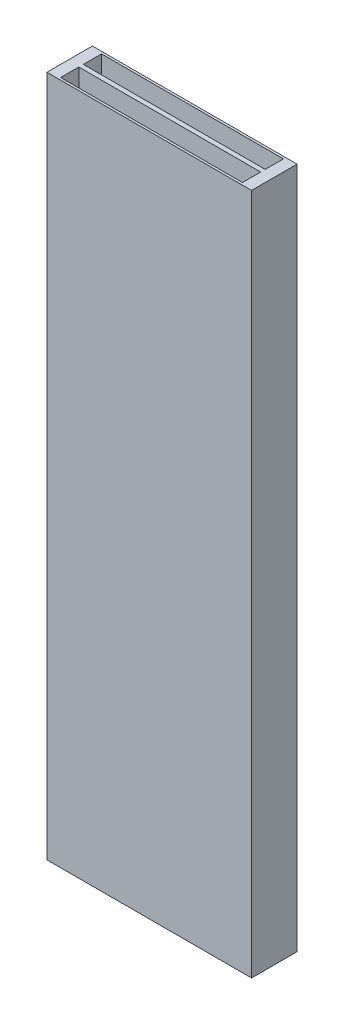
ISO-10303-21;
HEADER;
FILE_DESCRIPTION(('STEP AP214'),'2;1');
FILE_NAME('part.step','',(''),(''),'','','');
FILE_SCHEMA(('AUTOMOTIVE_DESIGN { 1 0 10303 214 1 1 1 1 }'));
ENDSEC;
DATA;
#1=APPLICATION_CONTEXT('core data for automotive mechanical design processes');
#2=APPLICATION_PROTOCOL_DEFINITION('international standard','automotive_design',2000,#1);
#3=PRODUCT_CONTEXT('',#1,'mechanical');
#4=PRODUCT('Part','Part','',(#3));
#5=PRODUCT_RELATED_PRODUCT_CATEGORY('part','',(#4));
#6=PRODUCT_DEFINITION_FORMATION('','',#4);
#7=PRODUCT_DEFINITION_CONTEXT('part definition',#1,'design');
#8=PRODUCT_DEFINITION('design','',#6,#7);
#9=PRODUCT_DEFINITION_SHAPE('','',#8);
#10=(LENGTH_UNIT() NAMED_UNIT(*) SI_UNIT(.MILLI.,.METRE.));
#11=(NAMED_UNIT(*) PLANE_ANGLE_UNIT() SI_UNIT($,.RADIAN.));
#12=(NAMED_UNIT(*) SI_UNIT($,.STERADIAN.) SOLID_ANGLE_UNIT());
#13=UNCERTAINTY_MEASURE_WITH_UNIT(LENGTH_MEASURE(1.E-05),#10,'distance_accuracy_value','');
#14=(GEOMETRIC_REPRESENTATION_CONTEXT(3) GLOBAL_UNCERTAINTY_ASSIGNED_CONTEXT((#13)) GLOBAL_UNIT_ASSIGNED_CONTEXT((#10,
#11,#12)) REPRESENTATION_CONTEXT('',''));
#15=CARTESIAN_POINT('',(0.,0.,0.));
#16=DIRECTION('',(0.,0.,1.));
#17=DIRECTION('',(1.,0.,0.));
#18=AXIS2_PLACEMENT_3D('',#15,#16,#17);
#19=CARTESIAN_POINT('',(0.,15.,0.));
#20=DIRECTION('',(0.,-1.,0.));
#21=DIRECTION('',(0.,0.,-1.));
#22=AXIS2_PLACEMENT_3D('',#19,#20,#21);
#23=PLANE('',#22);
#24=DIRECTION('',(0.,0.,-1.));
#25=VECTOR('',#24,1.);
#26=CARTESIAN_POINT('',(4.5,15.,1.));
#27=LINE('',#26,#25);
#28=CARTESIAN_POINT('',(4.5,15.,1.));
#29=VERTEX_POINT('',#28);
#30=CARTESIAN_POINT('',(4.5,15.,-1.));
#31=VERTEX_POINT('',#30);
#32=EDGE_CURVE('E194',#29,#31,#27,.T.);
#33=ORIENTED_EDGE('',*,*,#32,.T.);
#34=DIRECTION('',(-1.,0.,0.));
#35=VECTOR('',#34,1.);
#36=CARTESIAN_POINT('',(-4.5,15.,-1.));
#37=LINE('',#36,#35);
#38=CARTESIAN_POINT('',(-4.5,15.,-1.));
#39=VERTEX_POINT('',#38);
#40=EDGE_CURVE('E197',#31,#39,#37,.T.);
#41=ORIENTED_EDGE('',*,*,#40,.T.);
#42=DIRECTION('',(0.,0.,1.));
#43=VECTOR('',#42,1.);
#44=CARTESIAN_POINT('',(-4.5,15.,1.));
#45=LINE('',#44,#43);
#46=CARTESIAN_POINT('',(-4.5,15.,1.));
#47=VERTEX_POINT('',#46);
#48=EDGE_CURVE('E200',#39,#47,#45,.T.);
#49=ORIENTED_EDGE('',*,*,#48,.T.);
#50=DIRECTION('',(1.,0.,0.));
#51=VECTOR('',#50,1.);
#52=CARTESIAN_POINT('',(-4.5,15.,1.));
#53=LINE('',#52,#51);
#54=EDGE_CURVE('E202',#47,#29,#53,.T.);
#55=ORIENTED_EDGE('',*,*,#54,.T.);
#56=EDGE_LOOP('',(#33,#41,#49,#55));
#57=FACE_BOUND('',#56,.T.);
#58=DIRECTION('',(1.,0.,0.));
#59=VECTOR('',#58,1.);
#60=CARTESIAN_POINT('',(0.,15.,-0.9));
#61=LINE('',#60,#59);
#62=CARTESIAN_POINT('',(-4.,15.,-0.9));
#63=VERTEX_POINT('',#62);
#64=CARTESIAN_POINT('',(4.,15.,-0.9));
#65=VERTEX_POINT('',#64);
#66=EDGE_CURVE('E174',#63,#65,#61,.T.);
#67=ORIENTED_EDGE('',*,*,#66,.T.);
#68=DIRECTION('',(0.,0.,1.));
#69=VECTOR('',#68,1.);
#70=CARTESIAN_POINT('',(4.,15.,0.));
#71=LINE('',#70,#69);
#72=CARTESIAN_POINT('',(4.,15.,-0.1));
#73=VERTEX_POINT('',#72);
#74=EDGE_CURVE('E190',#65,#73,#71,.T.);
#75=ORIENTED_EDGE('',*,*,#74,.T.);
#76=DIRECTION('',(-1.,0.,0.));
#77=VECTOR('',#76,1.);
#78=CARTESIAN_POINT('',(0.,15.,-0.1));
#79=LINE('',#78,#77);
#80=CARTESIAN_POINT('',(-4.,15.,-0.1));
#81=VERTEX_POINT('',#80);
#82=EDGE_CURVE('E187',#73,#81,#79,.T.);
#83=ORIENTED_EDGE('',*,*,#82,.T.);
#84=DIRECTION('',(0.,0.,-1.));
#85=VECTOR('',#84,1.);
#86=CARTESIAN_POINT('',(-4.,15.,0.));
#87=LINE('',#86,#85);
#88=EDGE_CURVE('E184',#81,#63,#87,.T.);
#89=ORIENTED_EDGE('',*,*,#88,.T.);
#90=EDGE_LOOP('',(#67,#75,#83,#89));
#91=FACE_BOUND('',#90,.T.);
#92=DIRECTION('',(0.,0.,-1.));
#93=VECTOR('',#92,1.);
#94=CARTESIAN_POINT('',(4.,15.,0.));
#95=LINE('',#94,#93);
#96=CARTESIAN_POINT('',(4.,15.,0.9));
#97=VERTEX_POINT('',#96);
#98=CARTESIAN_POINT('',(4.,15.,0.1));
#99=VERTEX_POINT('',#98);
#100=EDGE_CURVE('E135',#97,#99,#95,.T.);
#101=ORIENTED_EDGE('',*,*,#100,.F.);
#102=DIRECTION('',(1.,0.,0.));
#103=VECTOR('',#102,1.);
#104=CARTESIAN_POINT('',(0.,15.,0.9));
#105=LINE('',#104,#103);
#106=CARTESIAN_POINT('',(-4.,15.,0.9));
#107=VERTEX_POINT('',#106);
#108=EDGE_CURVE('E155',#107,#97,#105,.T.);
#109=ORIENTED_EDGE('',*,*,#108,.F.);
#110=DIRECTION('',(0.,0.,1.));
#111=VECTOR('',#110,1.);
#112=CARTESIAN_POINT('',(-4.,15.,0.));
#113=LINE('',#112,#111);
#114=CARTESIAN_POINT('',(-4.,15.,0.1));
#115=VERTEX_POINT('',#114);
#116=EDGE_CURVE('E153',#115,#107,#113,.T.);
#117=ORIENTED_EDGE('',*,*,#116,.F.);
#118=DIRECTION('',(-1.,0.,0.));
#119=VECTOR('',#118,1.);
#120=CARTESIAN_POINT('',(0.,15.,0.1));
#121=LINE('',#120,#119);
#122=EDGE_CURVE('E147',#99,#115,#121,.T.);
#123=ORIENTED_EDGE('',*,*,#122,.F.);
#124=EDGE_LOOP('',(#101,#109,#117,#123));
#125=FACE_BOUND('',#124,.T.);
#126=ADVANCED_FACE('F36',(#57,#91,#125),#23,.F.);
#127=CARTESIAN_POINT('',(0.,-15.,0.));
#128=DIRECTION('',(0.,-1.,0.));
#129=DIRECTION('',(0.,0.,-1.));
#130=AXIS2_PLACEMENT_3D('',#127,#128,#129);
#131=PLANE('',#130);
#132=DIRECTION('',(0.,0.,-1.));
#133=VECTOR('',#132,1.);
#134=CARTESIAN_POINT('',(4.,-15.,-0.1));
#135=LINE('',#134,#133);
#136=CARTESIAN_POINT('',(4.,-15.,-0.1));
#137=VERTEX_POINT('',#136);
#138=CARTESIAN_POINT('',(4.,-15.,-0.9));
#139=VERTEX_POINT('',#138);
#140=EDGE_CURVE('E158',#137,#139,#135,.T.);
#141=ORIENTED_EDGE('',*,*,#140,.T.);
#142=DIRECTION('',(-1.,0.,0.));
#143=VECTOR('',#142,1.);
#144=CARTESIAN_POINT('',(-4.,-15.,-0.9));
#145=LINE('',#144,#143);
#146=CARTESIAN_POINT('',(-4.,-15.,-0.9));
#147=VERTEX_POINT('',#146);
#148=EDGE_CURVE('E161',#139,#147,#145,.T.);
#149=ORIENTED_EDGE('',*,*,#148,.T.);
#150=DIRECTION('',(0.,0.,1.));
#151=VECTOR('',#150,1.);
#152=CARTESIAN_POINT('',(-4.,-15.,-0.1));
#153=LINE('',#152,#151);
#154=CARTESIAN_POINT('',(-4.,-15.,-0.1));
#155=VERTEX_POINT('',#154);
#156=EDGE_CURVE('E164',#147,#155,#153,.T.);
#157=ORIENTED_EDGE('',*,*,#156,.T.);
#158=DIRECTION('',(1.,0.,0.));
#159=VECTOR('',#158,1.);
#160=CARTESIAN_POINT('',(-4.,-15.,-0.1));
#161=LINE('',#160,#159);
#162=EDGE_CURVE('E167',#155,#137,#161,.T.);
#163=ORIENTED_EDGE('',*,*,#162,.T.);
#164=EDGE_LOOP('',(#141,#149,#157,#163));
#165=FACE_BOUND('',#164,.T.);
#166=DIRECTION('',(0.,0.,-1.));
#167=VECTOR('',#166,1.);
#168=CARTESIAN_POINT('',(4.5,-15.,1.));
#169=LINE('',#168,#167);
#170=CARTESIAN_POINT('',(4.5,-15.,1.));
#171=VERTEX_POINT('',#170);
#172=CARTESIAN_POINT('',(4.5,-15.,-1.));
#173=VERTEX_POINT('',#172);
#174=EDGE_CURVE('E193',#171,#173,#169,.T.);
#175=ORIENTED_EDGE('',*,*,#174,.F.);
#176=DIRECTION('',(1.,0.,0.));
#177=VECTOR('',#176,1.);
#178=CARTESIAN_POINT('',(-4.5,-15.,1.));
#179=LINE('',#178,#177);
#180=CARTESIAN_POINT('',(-4.5,-15.,1.));
#181=VERTEX_POINT('',#180);
#182=EDGE_CURVE('E198',#181,#171,#179,.T.);
#183=ORIENTED_EDGE('',*,*,#182,.F.);
#184=DIRECTION('',(0.,0.,1.));
#185=VECTOR('',#184,1.);
#186=CARTESIAN_POINT('',(-4.5,-15.,1.));
#187=LINE('',#186,#185);
#188=CARTESIAN_POINT('',(-4.5,-15.,-1.));
#189=VERTEX_POINT('',#188);
#190=EDGE_CURVE('E209',#189,#181,#187,.T.);
#191=ORIENTED_EDGE('',*,*,#190,.F.);
#192=DIRECTION('',(-1.,0.,0.));
#193=VECTOR('',#192,1.);
#194=CARTESIAN_POINT('',(-4.5,-15.,-1.));
#195=LINE('',#194,#193);
#196=EDGE_CURVE('E207',#173,#189,#195,.T.);
#197=ORIENTED_EDGE('',*,*,#196,.F.);
#198=EDGE_LOOP('',(#175,#183,#191,#197));
#199=FACE_BOUND('',#198,.T.);
#200=DIRECTION('',(-1.,0.,0.));
#201=VECTOR('',#200,1.);
#202=CARTESIAN_POINT('',(-4.,-15.,0.9));
#203=LINE('',#202,#201);
#204=CARTESIAN_POINT('',(4.,-15.,0.9));
#205=VERTEX_POINT('',#204);
#206=CARTESIAN_POINT('',(-4.,-15.,0.9));
#207=VERTEX_POINT('',#206);
#208=EDGE_CURVE('E137',#205,#207,#203,.T.);
#209=ORIENTED_EDGE('',*,*,#208,.F.);
#210=DIRECTION('',(0.,0.,1.));
#211=VECTOR('',#210,1.);
#212=CARTESIAN_POINT('',(4.,-15.,0.1));
#213=LINE('',#212,#211);
#214=CARTESIAN_POINT('',(4.,-15.,0.1));
#215=VERTEX_POINT('',#214);
#216=EDGE_CURVE('E128',#215,#205,#213,.T.);
#217=ORIENTED_EDGE('',*,*,#216,.F.);
#218=DIRECTION('',(1.,0.,0.));
#219=VECTOR('',#218,1.);
#220=CARTESIAN_POINT('',(-4.,-15.,0.1));
#221=LINE('',#220,#219);
#222=CARTESIAN_POINT('',(-4.,-15.,0.1));
#223=VERTEX_POINT('',#222);
#224=EDGE_CURVE('E122',#223,#215,#221,.T.);
#225=ORIENTED_EDGE('',*,*,#224,.F.);
#226=DIRECTION('',(0.,0.,-1.));
#227=VECTOR('',#226,1.);
#228=CARTESIAN_POINT('',(-4.,-15.,0.1));
#229=LINE('',#228,#227);
#230=EDGE_CURVE('E127',#207,#223,#229,.T.);
#231=ORIENTED_EDGE('',*,*,#230,.F.);
#232=EDGE_LOOP('',(#209,#217,#225,#231));
#233=FACE_BOUND('',#232,.T.);
#234=ADVANCED_FACE('F140',(#165,#199,#233),#131,.T.);
#235=CARTESIAN_POINT('',(4.5,15.,1.));
#236=DIRECTION('',(-1.,0.,0.));
#237=DIRECTION('',(0.,0.,1.));
#238=AXIS2_PLACEMENT_3D('',#235,#236,#237);
#239=PLANE('',#238);
#240=ORIENTED_EDGE('',*,*,#174,.T.);
#241=DIRECTION('',(0.,-1.,0.));
#242=VECTOR('',#241,1.);
#243=CARTESIAN_POINT('',(4.5,15.,-1.));
#244=LINE('',#243,#242);
#245=EDGE_CURVE('E11',#31,#173,#244,.T.);
#246=ORIENTED_EDGE('',*,*,#245,.F.);
#247=ORIENTED_EDGE('',*,*,#32,.F.);
#248=DIRECTION('',(0.,-1.,0.));
#249=VECTOR('',#248,1.);
#250=CARTESIAN_POINT('',(4.5,15.,1.));
#251=LINE('',#250,#249);
#252=EDGE_CURVE('E204',#29,#171,#251,.T.);
#253=ORIENTED_EDGE('',*,*,#252,.T.);
#254=EDGE_LOOP('',(#240,#246,#247,#253));
#255=FACE_BOUND('',#254,.T.);
#256=ADVANCED_FACE('F38',(#255),#239,.F.);
#257=CARTESIAN_POINT('',(-4.5,15.,-1.));
#258=DIRECTION('',(0.,0.,1.));
#259=DIRECTION('',(1.,0.,0.));
#260=AXIS2_PLACEMENT_3D('',#257,#258,#259);
#261=PLANE('',#260);
#262=ORIENTED_EDGE('',*,*,#196,.T.);
#263=DIRECTION('',(0.,-1.,0.));
#264=VECTOR('',#263,1.);
#265=CARTESIAN_POINT('',(-4.5,15.,-1.));
#266=LINE('',#265,#264);
#267=EDGE_CURVE('E44',#39,#189,#266,.T.);
#268=ORIENTED_EDGE('',*,*,#267,.F.);
#269=ORIENTED_EDGE('',*,*,#40,.F.);
#270=ORIENTED_EDGE('',*,*,#245,.T.);
#271=EDGE_LOOP('',(#262,#268,#269,#270));
#272=FACE_BOUND('',#271,.T.);
#273=ADVANCED_FACE('F236',(#272),#261,.F.);
#274=CARTESIAN_POINT('',(-4.5,15.,1.));
#275=DIRECTION('',(1.,0.,0.));
#276=DIRECTION('',(0.,0.,-1.));
#277=AXIS2_PLACEMENT_3D('',#274,#275,#276);
#278=PLANE('',#277);
#279=ORIENTED_EDGE('',*,*,#190,.T.);
#280=DIRECTION('',(0.,-1.,0.));
#281=VECTOR('',#280,1.);
#282=CARTESIAN_POINT('',(-4.5,15.,1.));
#283=LINE('',#282,#281);
#284=EDGE_CURVE('E214',#47,#181,#283,.T.);
#285=ORIENTED_EDGE('',*,*,#284,.F.);
#286=ORIENTED_EDGE('',*,*,#48,.F.);
#287=ORIENTED_EDGE('',*,*,#267,.T.);
#288=EDGE_LOOP('',(#279,#285,#286,#287));
#289=FACE_BOUND('',#288,.T.);
#290=ADVANCED_FACE('F221',(#289),#278,.F.);
#291=CARTESIAN_POINT('',(-4.5,15.,1.));
#292=DIRECTION('',(0.,0.,-1.));
#293=DIRECTION('',(-1.,0.,0.));
#294=AXIS2_PLACEMENT_3D('',#291,#292,#293);
#295=PLANE('',#294);
#296=ORIENTED_EDGE('',*,*,#182,.T.);
#297=ORIENTED_EDGE('',*,*,#252,.F.);
#298=ORIENTED_EDGE('',*,*,#54,.F.);
#299=ORIENTED_EDGE('',*,*,#284,.T.);
#300=EDGE_LOOP('',(#296,#297,#298,#299));
#301=FACE_BOUND('',#300,.T.);
#302=ADVANCED_FACE('F229',(#301),#295,.F.);
#303=CARTESIAN_POINT('',(4.,-15.,-0.1));
#304=DIRECTION('',(1.,0.,0.));
#305=DIRECTION('',(0.,0.,-1.));
#306=AXIS2_PLACEMENT_3D('',#303,#304,#305);
#307=PLANE('',#306);
#308=DIRECTION('',(0.,1.,0.));
#309=VECTOR('',#308,1.);
#310=CARTESIAN_POINT('',(4.,-15.,-0.9));
#311=LINE('',#310,#309);
#312=EDGE_CURVE('E170',#139,#65,#311,.T.);
#313=ORIENTED_EDGE('',*,*,#312,.F.);
#314=ORIENTED_EDGE('',*,*,#140,.F.);
#315=DIRECTION('',(0.,1.,0.));
#316=VECTOR('',#315,1.);
#317=CARTESIAN_POINT('',(4.,-15.,-0.1));
#318=LINE('',#317,#316);
#319=EDGE_CURVE('E171',#137,#73,#318,.T.);
#320=ORIENTED_EDGE('',*,*,#319,.T.);
#321=ORIENTED_EDGE('',*,*,#74,.F.);
#322=EDGE_LOOP('',(#313,#314,#320,#321));
#323=FACE_BOUND('',#322,.T.);
#324=ADVANCED_FACE('F251',(#323),#307,.F.);
#325=CARTESIAN_POINT('',(-4.,-15.,-0.1));
#326=DIRECTION('',(0.,0.,1.));
#327=DIRECTION('',(1.,0.,0.));
#328=AXIS2_PLACEMENT_3D('',#325,#326,#327);
#329=PLANE('',#328);
#330=ORIENTED_EDGE('',*,*,#319,.F.);
#331=ORIENTED_EDGE('',*,*,#162,.F.);
#332=DIRECTION('',(0.,1.,0.));
#333=VECTOR('',#332,1.);
#334=CARTESIAN_POINT('',(-4.,-15.,-0.1));
#335=LINE('',#334,#333);
#336=EDGE_CURVE('E175',#155,#81,#335,.T.);
#337=ORIENTED_EDGE('',*,*,#336,.T.);
#338=ORIENTED_EDGE('',*,*,#82,.F.);
#339=EDGE_LOOP('',(#330,#331,#337,#338));
#340=FACE_BOUND('',#339,.T.);
#341=ADVANCED_FACE('F258',(#340),#329,.F.);
#342=CARTESIAN_POINT('',(-4.,-15.,-0.1));
#343=DIRECTION('',(-1.,0.,0.));
#344=DIRECTION('',(0.,0.,1.));
#345=AXIS2_PLACEMENT_3D('',#342,#343,#344);
#346=PLANE('',#345);
#347=ORIENTED_EDGE('',*,*,#336,.F.);
#348=ORIENTED_EDGE('',*,*,#156,.F.);
#349=DIRECTION('',(0.,1.,0.));
#350=VECTOR('',#349,1.);
#351=CARTESIAN_POINT('',(-4.,-15.,-0.9));
#352=LINE('',#351,#350);
#353=EDGE_CURVE('E178',#147,#63,#352,.T.);
#354=ORIENTED_EDGE('',*,*,#353,.T.);
#355=ORIENTED_EDGE('',*,*,#88,.F.);
#356=EDGE_LOOP('',(#347,#348,#354,#355));
#357=FACE_BOUND('',#356,.T.);
#358=ADVANCED_FACE('F263',(#357),#346,.F.);
#359=CARTESIAN_POINT('',(-4.,-15.,-0.9));
#360=DIRECTION('',(0.,0.,-1.));
#361=DIRECTION('',(-1.,0.,0.));
#362=AXIS2_PLACEMENT_3D('',#359,#360,#361);
#363=PLANE('',#362);
#364=ORIENTED_EDGE('',*,*,#353,.F.);
#365=ORIENTED_EDGE('',*,*,#148,.F.);
#366=ORIENTED_EDGE('',*,*,#312,.T.);
#367=ORIENTED_EDGE('',*,*,#66,.F.);
#368=EDGE_LOOP('',(#364,#365,#366,#367));
#369=FACE_BOUND('',#368,.T.);
#370=ADVANCED_FACE('F271',(#369),#363,.F.);
#371=CARTESIAN_POINT('',(4.,-15.,0.1));
#372=DIRECTION('',(-1.,0.,0.));
#373=DIRECTION('',(0.,0.,1.));
#374=AXIS2_PLACEMENT_3D('',#371,#372,#373);
#375=PLANE('',#374);
#376=ORIENTED_EDGE('',*,*,#100,.T.);
#377=DIRECTION('',(0.,1.,0.));
#378=VECTOR('',#377,1.);
#379=CARTESIAN_POINT('',(4.,-15.,0.1));
#380=LINE('',#379,#378);
#381=EDGE_CURVE('E51',#215,#99,#380,.T.);
#382=ORIENTED_EDGE('',*,*,#381,.F.);
#383=ORIENTED_EDGE('',*,*,#216,.T.);
#384=DIRECTION('',(0.,1.,0.));
#385=VECTOR('',#384,1.);
#386=CARTESIAN_POINT('',(4.,-15.,0.9));
#387=LINE('',#386,#385);
#388=EDGE_CURVE('E145',#205,#97,#387,.T.);
#389=ORIENTED_EDGE('',*,*,#388,.T.);
#390=EDGE_LOOP('',(#376,#382,#383,#389));
#391=FACE_BOUND('',#390,.T.);
#392=ADVANCED_FACE('F131',(#391),#375,.T.);
#393=CARTESIAN_POINT('',(-4.,-15.,0.9));
#394=DIRECTION('',(0.,0.,-1.));
#395=DIRECTION('',(-1.,0.,0.));
#396=AXIS2_PLACEMENT_3D('',#393,#394,#395);
#397=PLANE('',#396);
#398=ORIENTED_EDGE('',*,*,#108,.T.);
#399=ORIENTED_EDGE('',*,*,#388,.F.);
#400=ORIENTED_EDGE('',*,*,#208,.T.);
#401=DIRECTION('',(0.,1.,0.));
#402=VECTOR('',#401,1.);
#403=CARTESIAN_POINT('',(-4.,-15.,0.9));
#404=LINE('',#403,#402);
#405=EDGE_CURVE('E148',#207,#107,#404,.T.);
#406=ORIENTED_EDGE('',*,*,#405,.T.);
#407=EDGE_LOOP('',(#398,#399,#400,#406));
#408=FACE_BOUND('',#407,.T.);
#409=ADVANCED_FACE('F283',(#408),#397,.T.);
#410=CARTESIAN_POINT('',(-4.,-15.,0.1));
#411=DIRECTION('',(1.,0.,0.));
#412=DIRECTION('',(0.,0.,-1.));
#413=AXIS2_PLACEMENT_3D('',#410,#411,#412);
#414=PLANE('',#413);
#415=ORIENTED_EDGE('',*,*,#116,.T.);
#416=ORIENTED_EDGE('',*,*,#405,.F.);
#417=ORIENTED_EDGE('',*,*,#230,.T.);
#418=DIRECTION('',(0.,1.,0.));
#419=VECTOR('',#418,1.);
#420=CARTESIAN_POINT('',(-4.,-15.,0.1));
#421=LINE('',#420,#419);
#422=EDGE_CURVE('E56',#223,#115,#421,.T.);
#423=ORIENTED_EDGE('',*,*,#422,.T.);
#424=EDGE_LOOP('',(#415,#416,#417,#423));
#425=FACE_BOUND('',#424,.T.);
#426=ADVANCED_FACE('F286',(#425),#414,.T.);
#427=CARTESIAN_POINT('',(-4.,-15.,0.1));
#428=DIRECTION('',(0.,0.,1.));
#429=DIRECTION('',(1.,0.,0.));
#430=AXIS2_PLACEMENT_3D('',#427,#428,#429);
#431=PLANE('',#430);
#432=ORIENTED_EDGE('',*,*,#122,.T.);
#433=ORIENTED_EDGE('',*,*,#422,.F.);
#434=ORIENTED_EDGE('',*,*,#224,.T.);
#435=ORIENTED_EDGE('',*,*,#381,.T.);
#436=EDGE_LOOP('',(#432,#433,#434,#435));
#437=FACE_BOUND('',#436,.T.);
#438=ADVANCED_FACE('F123',(#437),#431,.T.);
#439=CLOSED_SHELL('',(#126,#234,#256,#273,#290,#302,#324,#341,#358,#370,#392,#409,#426,#438));
#440=MANIFOLD_SOLID_BREP('B2',#439);
#441=ADVANCED_BREP_SHAPE_REPRESENTATION('',(#18,#440),#14);
#442=SHAPE_DEFINITION_REPRESENTATION(#9,#441);
ENDSEC;
END-ISO-10303-21;
